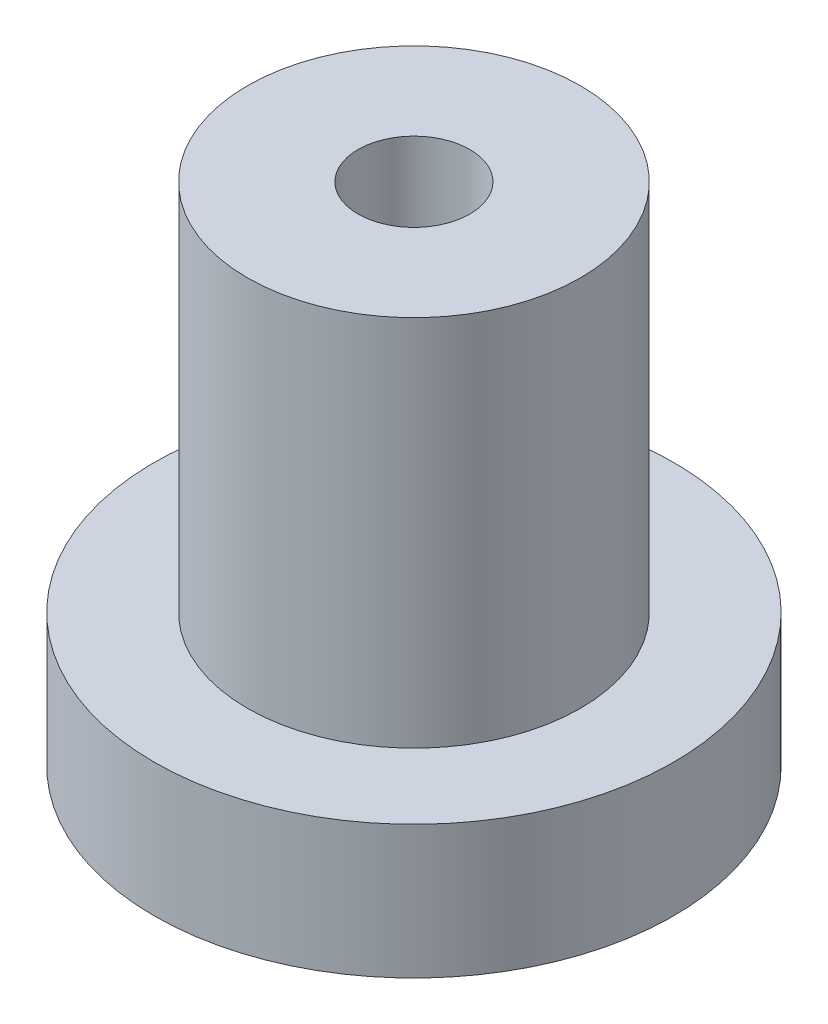
ISO-10303-21;
HEADER;
FILE_DESCRIPTION(('STEP AP214'),'2;1');
FILE_NAME('part.step','',(''),(''),'','','');
FILE_SCHEMA(('AUTOMOTIVE_DESIGN { 1 0 10303 214 1 1 1 1 }'));
ENDSEC;
DATA;
#1=APPLICATION_CONTEXT('core data for automotive mechanical design processes');
#2=APPLICATION_PROTOCOL_DEFINITION('international standard','automotive_design',2000,#1);
#3=PRODUCT_CONTEXT('',#1,'mechanical');
#4=PRODUCT('Part','Part','',(#3));
#5=PRODUCT_RELATED_PRODUCT_CATEGORY('part','',(#4));
#6=PRODUCT_DEFINITION_FORMATION('','',#4);
#7=PRODUCT_DEFINITION_CONTEXT('part definition',#1,'design');
#8=PRODUCT_DEFINITION('design','',#6,#7);
#9=PRODUCT_DEFINITION_SHAPE('','',#8);
#10=(LENGTH_UNIT() NAMED_UNIT(*) SI_UNIT(.MILLI.,.METRE.));
#11=(NAMED_UNIT(*) PLANE_ANGLE_UNIT() SI_UNIT($,.RADIAN.));
#12=(NAMED_UNIT(*) SI_UNIT($,.STERADIAN.) SOLID_ANGLE_UNIT());
#13=UNCERTAINTY_MEASURE_WITH_UNIT(LENGTH_MEASURE(1.E-05),#10,'distance_accuracy_value','');
#14=(GEOMETRIC_REPRESENTATION_CONTEXT(3) GLOBAL_UNCERTAINTY_ASSIGNED_CONTEXT((#13)) GLOBAL_UNIT_ASSIGNED_CONTEXT((#10,
#11,#12)) REPRESENTATION_CONTEXT('',''));
#15=CARTESIAN_POINT('',(0.,0.,0.));
#16=DIRECTION('',(0.,0.,1.));
#17=DIRECTION('',(1.,0.,0.));
#18=AXIS2_PLACEMENT_3D('',#15,#16,#17);
#19=CARTESIAN_POINT('',(0.,5.,0.));
#20=DIRECTION('',(0.,-1.,0.));
#21=DIRECTION('',(0.,0.,-1.));
#22=AXIS2_PLACEMENT_3D('',#19,#20,#21);
#23=CYLINDRICAL_SURFACE('',#22,9.75);
#24=CARTESIAN_POINT('',(0.,5.,0.));
#25=DIRECTION('',(0.,1.,0.));
#26=DIRECTION('',(0.,0.,1.));
#27=AXIS2_PLACEMENT_3D('',#24,#25,#26);
#28=CIRCLE('',#27,9.75);
#29=CARTESIAN_POINT('',(0.,5.,9.75));
#30=VERTEX_POINT('',#29);
#31=EDGE_CURVE('E45',#30,#30,#28,.T.);
#32=ORIENTED_EDGE('',*,*,#31,.F.);
#33=EDGE_LOOP('',(#32));
#34=FACE_BOUND('',#33,.T.);
#35=CARTESIAN_POINT('',(0.,0.,0.));
#36=DIRECTION('',(0.,1.,0.));
#37=DIRECTION('',(0.,0.,1.));
#38=AXIS2_PLACEMENT_3D('',#35,#36,#37);
#39=CIRCLE('',#38,9.75);
#40=CARTESIAN_POINT('',(0.,0.,9.75));
#41=VERTEX_POINT('',#40);
#42=EDGE_CURVE('E40',#41,#41,#39,.T.);
#43=ORIENTED_EDGE('',*,*,#42,.T.);
#44=EDGE_LOOP('',(#43));
#45=FACE_BOUND('',#44,.T.);
#46=ADVANCED_FACE('F37',(#34,#45),#23,.T.);
#47=CARTESIAN_POINT('',(0.,5.,0.));
#48=DIRECTION('',(0.,1.,0.));
#49=DIRECTION('',(0.,0.,1.));
#50=AXIS2_PLACEMENT_3D('',#47,#48,#49);
#51=PLANE('',#50);
#52=CARTESIAN_POINT('',(0.,5.,0.));
#53=DIRECTION('',(0.,1.,0.));
#54=DIRECTION('',(0.,0.,1.));
#55=AXIS2_PLACEMENT_3D('',#52,#53,#54);
#56=CIRCLE('',#55,6.25);
#57=CARTESIAN_POINT('',(0.,5.,6.25));
#58=VERTEX_POINT('',#57);
#59=EDGE_CURVE('E10',#58,#58,#56,.T.);
#60=ORIENTED_EDGE('',*,*,#59,.F.);
#61=EDGE_LOOP('',(#60));
#62=FACE_BOUND('',#61,.T.);
#63=ORIENTED_EDGE('',*,*,#31,.T.);
#64=EDGE_LOOP('',(#63));
#65=FACE_BOUND('',#64,.T.);
#66=ADVANCED_FACE('F81',(#62,#65),#51,.T.);
#67=CARTESIAN_POINT('',(0.,0.,0.));
#68=DIRECTION('',(0.,1.,0.));
#69=DIRECTION('',(0.,0.,1.));
#70=AXIS2_PLACEMENT_3D('',#67,#68,#69);
#71=PLANE('',#70);
#72=CARTESIAN_POINT('',(0.,0.,0.));
#73=DIRECTION('',(0.,1.,0.));
#74=DIRECTION('',(0.,0.,1.));
#75=AXIS2_PLACEMENT_3D('',#72,#73,#74);
#76=CIRCLE('',#75,2.1);
#77=CARTESIAN_POINT('',(0.,0.,2.1));
#78=VERTEX_POINT('',#77);
#79=EDGE_CURVE('E56',#78,#78,#76,.T.);
#80=ORIENTED_EDGE('',*,*,#79,.T.);
#81=EDGE_LOOP('',(#80));
#82=FACE_BOUND('',#81,.T.);
#83=ORIENTED_EDGE('',*,*,#42,.F.);
#84=EDGE_LOOP('',(#83));
#85=FACE_BOUND('',#84,.T.);
#86=ADVANCED_FACE('F76',(#82,#85),#71,.F.);
#87=CARTESIAN_POINT('',(0.,19.,0.));
#88=DIRECTION('',(0.,-1.,0.));
#89=DIRECTION('',(0.,0.,-1.));
#90=AXIS2_PLACEMENT_3D('',#87,#88,#89);
#91=CYLINDRICAL_SURFACE('',#90,6.25);
#92=CARTESIAN_POINT('',(0.,19.,0.));
#93=DIRECTION('',(0.,1.,0.));
#94=DIRECTION('',(0.,0.,1.));
#95=AXIS2_PLACEMENT_3D('',#92,#93,#94);
#96=CIRCLE('',#95,6.25);
#97=CARTESIAN_POINT('',(0.,19.,6.25));
#98=VERTEX_POINT('',#97);
#99=EDGE_CURVE('E52',#98,#98,#96,.T.);
#100=ORIENTED_EDGE('',*,*,#99,.F.);
#101=EDGE_LOOP('',(#100));
#102=FACE_BOUND('',#101,.T.);
#103=ORIENTED_EDGE('',*,*,#59,.T.);
#104=EDGE_LOOP('',(#103));
#105=FACE_BOUND('',#104,.T.);
#106=ADVANCED_FACE('F71',(#102,#105),#91,.T.);
#107=CARTESIAN_POINT('',(0.,19.,0.));
#108=DIRECTION('',(0.,1.,0.));
#109=DIRECTION('',(0.,0.,1.));
#110=AXIS2_PLACEMENT_3D('',#107,#108,#109);
#111=PLANE('',#110);
#112=CARTESIAN_POINT('',(0.,19.,0.));
#113=DIRECTION('',(0.,1.,0.));
#114=DIRECTION('',(0.,0.,1.));
#115=AXIS2_PLACEMENT_3D('',#112,#113,#114);
#116=CIRCLE('',#115,2.1);
#117=CARTESIAN_POINT('',(0.,19.,2.1));
#118=VERTEX_POINT('',#117);
#119=EDGE_CURVE('E60',#118,#118,#116,.T.);
#120=ORIENTED_EDGE('',*,*,#119,.F.);
#121=EDGE_LOOP('',(#120));
#122=FACE_BOUND('',#121,.T.);
#123=ORIENTED_EDGE('',*,*,#99,.T.);
#124=EDGE_LOOP('',(#123));
#125=FACE_BOUND('',#124,.T.);
#126=ADVANCED_FACE('F68',(#122,#125),#111,.T.);
#127=CARTESIAN_POINT('',(0.,-25.,0.));
#128=DIRECTION('',(0.,1.,0.));
#129=DIRECTION('',(0.,0.,1.));
#130=AXIS2_PLACEMENT_3D('',#127,#128,#129);
#131=CYLINDRICAL_SURFACE('',#130,2.1);
#132=ORIENTED_EDGE('',*,*,#119,.T.);
#133=EDGE_LOOP('',(#132));
#134=FACE_BOUND('',#133,.T.);
#135=ORIENTED_EDGE('',*,*,#79,.F.);
#136=EDGE_LOOP('',(#135));
#137=FACE_BOUND('',#136,.T.);
#138=ADVANCED_FACE('F65',(#134,#137),#131,.F.);
#139=CLOSED_SHELL('',(#46,#66,#86,#106,#126,#138));
#140=MANIFOLD_SOLID_BREP('B2',#139);
#141=ADVANCED_BREP_SHAPE_REPRESENTATION('',(#18,#140),#14);
#142=SHAPE_DEFINITION_REPRESENTATION(#9,#141);
ENDSEC;
END-ISO-10303-21;
